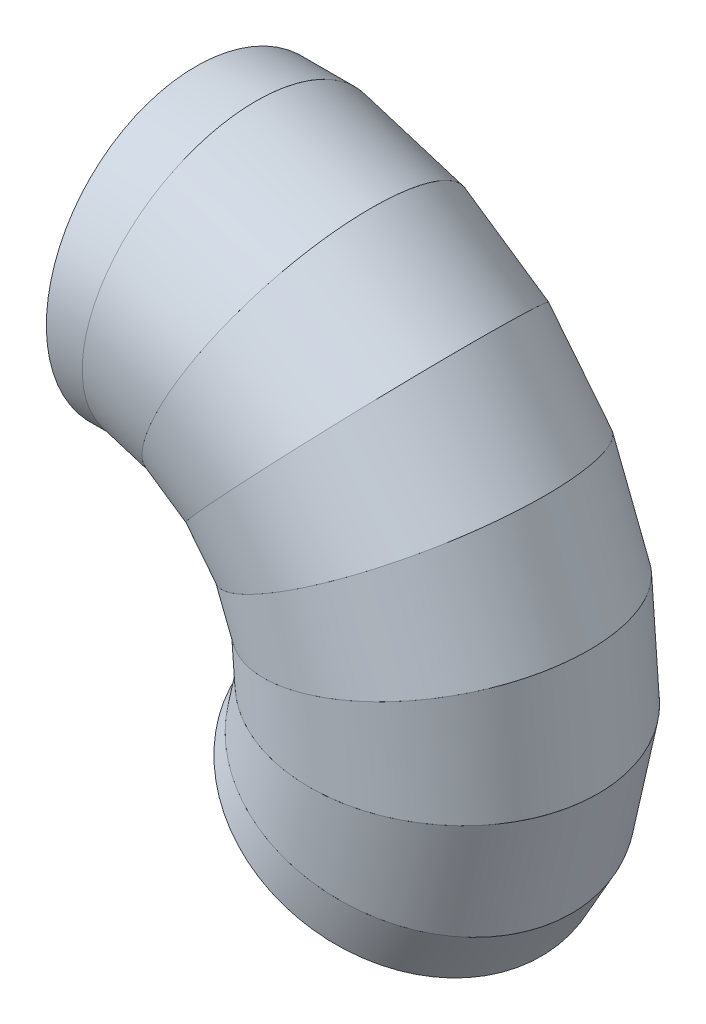
ISO-10303-21;
HEADER;
FILE_DESCRIPTION(('STEP AP214'),'2;1');
FILE_NAME('part.step','',(''),(''),'','','');
FILE_SCHEMA(('AUTOMOTIVE_DESIGN { 1 0 10303 214 1 1 1 1 }'));
ENDSEC;
DATA;
#1=APPLICATION_CONTEXT('core data for automotive mechanical design processes');
#2=APPLICATION_PROTOCOL_DEFINITION('international standard','automotive_design',2000,#1);
#3=PRODUCT_CONTEXT('',#1,'mechanical');
#4=PRODUCT('Part','Part','',(#3));
#5=PRODUCT_RELATED_PRODUCT_CATEGORY('part','',(#4));
#6=PRODUCT_DEFINITION_FORMATION('','',#4);
#7=PRODUCT_DEFINITION_CONTEXT('part definition',#1,'design');
#8=PRODUCT_DEFINITION('design','',#6,#7);
#9=PRODUCT_DEFINITION_SHAPE('','',#8);
#10=(LENGTH_UNIT() NAMED_UNIT(*) SI_UNIT(.MILLI.,.METRE.));
#11=(NAMED_UNIT(*) PLANE_ANGLE_UNIT() SI_UNIT($,.RADIAN.));
#12=(NAMED_UNIT(*) SI_UNIT($,.STERADIAN.) SOLID_ANGLE_UNIT());
#13=UNCERTAINTY_MEASURE_WITH_UNIT(LENGTH_MEASURE(1.E-05),#10,'distance_accuracy_value','');
#14=(GEOMETRIC_REPRESENTATION_CONTEXT(3) GLOBAL_UNCERTAINTY_ASSIGNED_CONTEXT((#13)) GLOBAL_UNIT_ASSIGNED_CONTEXT((#10,
#11,#12)) REPRESENTATION_CONTEXT('',''));
#15=CARTESIAN_POINT('',(0.,0.,0.));
#16=DIRECTION('',(0.,0.,1.));
#17=DIRECTION('',(1.,0.,0.));
#18=AXIS2_PLACEMENT_3D('',#15,#16,#17);
#19=CARTESIAN_POINT('',(259.807621135331,-150.000000000001,0.));
#20=DIRECTION('',(0.500000000000004,0.866025403784436,0.));
#21=DIRECTION('',(0.,0.,-1.));
#22=AXIS2_PLACEMENT_3D('',#19,#20,#21);
#23=PLANE('',#22);
#24=CARTESIAN_POINT('',(259.807621135331,-150.000000000001,0.));
#25=DIRECTION('',(-0.500000000000004,-0.866025403784436,0.));
#26=DIRECTION('',(0.,0.,-1.));
#27=AXIS2_PLACEMENT_3D('',#24,#25,#26);
#28=CIRCLE('',#27,180.);
#29=CARTESIAN_POINT('',(259.807621135331,-150.000000000001,-180.));
#30=VERTEX_POINT('',#29);
#31=EDGE_CURVE('E12',#30,#30,#28,.T.);
#32=ORIENTED_EDGE('',*,*,#31,.T.);
#33=EDGE_LOOP('',(#32));
#34=FACE_BOUND('',#33,.T.);
#35=CARTESIAN_POINT('',(259.807621135331,-150.000000000001,0.));
#36=DIRECTION('',(-0.500000000000004,-0.866025403784436,0.));
#37=DIRECTION('',(0.,0.,-1.));
#38=AXIS2_PLACEMENT_3D('',#35,#36,#37);
#39=CIRCLE('',#38,177.);
#40=CARTESIAN_POINT('',(259.807621135331,-150.000000000001,-177.));
#41=VERTEX_POINT('',#40);
#42=EDGE_CURVE('E68',#41,#41,#39,.T.);
#43=ORIENTED_EDGE('',*,*,#42,.F.);
#44=EDGE_LOOP('',(#43));
#45=FACE_BOUND('',#44,.T.);
#46=ADVANCED_FACE('F60',(#34,#45),#23,.F.);
#47=CARTESIAN_POINT('',(295.981800715506,-87.3444830450185,0.));
#48=DIRECTION('',(-0.500000000000004,-0.866025403784436,0.));
#49=DIRECTION('',(0.,0.,1.));
#50=AXIS2_PLACEMENT_3D('',#47,#48,#49);
#51=CYLINDRICAL_SURFACE('',#50,180.);
#52=CARTESIAN_POINT('',(282.41648337294,-110.840301903137,0.));
#53=DIRECTION('',(0.365341024366406,0.9308737486442,0.));
#54=DIRECTION('',(-0.9308737486442,0.365341024366406,0.));
#55=AXIS2_PLACEMENT_3D('',#52,#53,#54);
#56=ELLIPSE('',#55,182.033159996793,180.);
#57=CARTESIAN_POINT('',(112.966593349176,-44.3361207612548,0.));
#58=VERTEX_POINT('',#57);
#59=EDGE_CURVE('E72',#58,#58,#56,.T.);
#60=ORIENTED_EDGE('',*,*,#59,.F.);
#61=EDGE_LOOP('',(#60));
#62=FACE_BOUND('',#61,.T.);
#63=ORIENTED_EDGE('',*,*,#31,.F.);
#64=EDGE_LOOP('',(#63));
#65=FACE_BOUND('',#64,.T.);
#66=ADVANCED_FACE('F62',(#62,#65),#51,.T.);
#67=CARTESIAN_POINT('',(295.981800715506,-87.3444830450185,0.));
#68=DIRECTION('',(-0.500000000000004,-0.866025403784436,0.));
#69=DIRECTION('',(0.,0.,1.));
#70=AXIS2_PLACEMENT_3D('',#67,#68,#69);
#71=CYLINDRICAL_SURFACE('',#70,177.);
#72=CARTESIAN_POINT('',(282.41648337294,-110.840301903137,0.));
#73=DIRECTION('',(0.365341024366406,0.9308737486442,0.));
#74=DIRECTION('',(-0.9308737486442,0.365341024366406,0.));
#75=AXIS2_PLACEMENT_3D('',#72,#73,#74);
#76=ELLIPSE('',#75,178.999273996846,177.);
#77=CARTESIAN_POINT('',(115.790758182905,-45.4445237802862,0.));
#78=VERTEX_POINT('',#77);
#79=EDGE_CURVE('E64',#78,#78,#76,.T.);
#80=ORIENTED_EDGE('',*,*,#79,.T.);
#81=EDGE_LOOP('',(#80));
#82=FACE_BOUND('',#81,.T.);
#83=ORIENTED_EDGE('',*,*,#42,.T.);
#84=EDGE_LOOP('',(#83));
#85=FACE_BOUND('',#84,.T.);
#86=ADVANCED_FACE('F81',(#82,#85),#71,.F.);
#87=CARTESIAN_POINT('',(282.41648337294,-110.840301903137,0.));
#88=DIRECTION('',(-0.365341024366406,-0.9308737486442,0.));
#89=DIRECTION('',(-0.9308737486442,0.365341024366406,0.));
#90=AXIS2_PLACEMENT_3D('',#87,#88,#89);
#91=PLANE('',#90);
#92=ORIENTED_EDGE('',*,*,#79,.F.);
#93=EDGE_LOOP('',(#92));
#94=FACE_BOUND('',#93,.T.);
#95=ORIENTED_EDGE('',*,*,#59,.T.);
#96=EDGE_LOOP('',(#95));
#97=FACE_BOUND('',#96,.T.);
#98=ADVANCED_FACE('F84',(#94,#97),#91,.F.);
#99=CLOSED_SHELL('',(#46,#66,#86,#98));
#100=MANIFOLD_SOLID_BREP('B2',#99);
#101=CARTESIAN_POINT('',(308.577398105116,3.77815455909008,0.));
#102=DIRECTION('',(-0.222520933956311,-0.974927912181825,0.));
#103=DIRECTION('',(0.974927912181825,-0.222520933956311,0.));
#104=AXIS2_PLACEMENT_3D('',#101,#102,#103);
#105=CYLINDRICAL_SURFACE('',#104,180.);
#106=CARTESIAN_POINT('',(302.540263936152,-22.6722584706537,0.));
#107=DIRECTION('',(0.0747300935864207,0.997203797181181,0.));
#108=DIRECTION('',(-0.997203797181181,0.0747300935864207,0.));
#109=AXIS2_PLACEMENT_3D('',#106,#107,#108);
#110=ELLIPSE('',#109,182.033159996793,180.);
#111=CARTESIAN_POINT('',(121.016105574461,-9.0689033882615,0.));
#112=VERTEX_POINT('',#111);
#113=EDGE_CURVE('E59',#112,#112,#110,.F.);
#114=ORIENTED_EDGE('',*,*,#113,.T.);
#115=EDGE_LOOP('',(#114));
#116=FACE_BOUND('',#115,.T.);
#117=CARTESIAN_POINT('',(282.416483372942,-110.840301903133,0.));
#118=DIRECTION('',(-0.365341024366392,-0.930873748644206,0.));
#119=DIRECTION('',(0.930873748644206,-0.365341024366392,0.));
#120=AXIS2_PLACEMENT_3D('',#117,#118,#119);
#121=ELLIPSE('',#120,182.033159996793,180.);
#122=CARTESIAN_POINT('',(451.866373396707,-177.344483045013,0.));
#123=VERTEX_POINT('',#122);
#124=EDGE_CURVE('E140',#123,#123,#121,.F.);
#125=ORIENTED_EDGE('',*,*,#124,.T.);
#126=EDGE_LOOP('',(#125));
#127=FACE_BOUND('',#126,.T.);
#128=ADVANCED_FACE('F130',(#116,#127),#105,.T.);
#129=CARTESIAN_POINT('',(308.577398105116,3.77815455909008,0.));
#130=DIRECTION('',(-0.222520933956311,-0.974927912181825,0.));
#131=DIRECTION('',(0.974927912181825,-0.222520933956311,0.));
#132=AXIS2_PLACEMENT_3D('',#129,#130,#131);
#133=CYLINDRICAL_SURFACE('',#132,177.);
#134=CARTESIAN_POINT('',(302.540263936152,-22.6722584706537,0.));
#135=DIRECTION('',(0.0747300935864207,0.997203797181181,0.));
#136=DIRECTION('',(-0.997203797181181,0.0747300935864207,0.));
#137=AXIS2_PLACEMENT_3D('',#134,#135,#136);
#138=ELLIPSE('',#137,178.999273996846,177.);
#139=CARTESIAN_POINT('',(124.041508213823,-9.29562597296803,0.));
#140=VERTEX_POINT('',#139);
#141=EDGE_CURVE('E133',#140,#140,#138,.F.);
#142=ORIENTED_EDGE('',*,*,#141,.F.);
#143=EDGE_LOOP('',(#142));
#144=FACE_BOUND('',#143,.T.);
#145=CARTESIAN_POINT('',(282.416483372942,-110.840301903133,0.));
#146=DIRECTION('',(-0.365341024366392,-0.930873748644206,0.));
#147=DIRECTION('',(0.930873748644206,-0.365341024366392,0.));
#148=AXIS2_PLACEMENT_3D('',#145,#146,#147);
#149=ELLIPSE('',#148,178.999273996846,177.);
#150=CARTESIAN_POINT('',(449.042208562978,-176.236080025981,0.));
#151=VERTEX_POINT('',#150);
#152=EDGE_CURVE('E144',#151,#151,#149,.F.);
#153=ORIENTED_EDGE('',*,*,#152,.F.);
#154=EDGE_LOOP('',(#153));
#155=FACE_BOUND('',#154,.T.);
#156=ADVANCED_FACE('F150',(#144,#155),#133,.F.);
#157=CARTESIAN_POINT('',(302.540263936152,-22.6722584706537,0.));
#158=DIRECTION('',(0.0747300935864207,0.997203797181181,0.));
#159=DIRECTION('',(-0.997203797181181,0.0747300935864207,0.));
#160=AXIS2_PLACEMENT_3D('',#157,#158,#159);
#161=PLANE('',#160);
#162=ORIENTED_EDGE('',*,*,#113,.F.);
#163=EDGE_LOOP('',(#162));
#164=FACE_BOUND('',#163,.T.);
#165=ORIENTED_EDGE('',*,*,#141,.T.);
#166=EDGE_LOOP('',(#165));
#167=FACE_BOUND('',#166,.T.);
#168=ADVANCED_FACE('F152',(#164,#167),#161,.T.);
#169=CARTESIAN_POINT('',(282.416483372942,-110.840301903133,0.));
#170=DIRECTION('',(-0.365341024366392,-0.930873748644206,0.));
#171=DIRECTION('',(0.930873748644206,-0.365341024366392,0.));
#172=AXIS2_PLACEMENT_3D('',#169,#170,#171);
#173=PLANE('',#172);
#174=ORIENTED_EDGE('',*,*,#124,.F.);
#175=EDGE_LOOP('',(#174));
#176=FACE_BOUND('',#175,.T.);
#177=ORIENTED_EDGE('',*,*,#152,.T.);
#178=EDGE_LOOP('',(#177));
#179=FACE_BOUND('',#178,.T.);
#180=ADVANCED_FACE('F148',(#176,#179),#173,.T.);
#181=CLOSED_SHELL('',(#128,#156,#168,#180));
#182=MANIFOLD_SOLID_BREP('B7',#181);
#183=CARTESIAN_POINT('',(293.754539503476,94.56508655046,0.));
#184=DIRECTION('',(0.0747300935864282,-0.99720379718118,0.));
#185=DIRECTION('',(0.99720379718118,0.0747300935864282,0.));
#186=AXIS2_PLACEMENT_3D('',#183,#184,#185);
#187=CYLINDRICAL_SURFACE('',#186,180.);
#188=CARTESIAN_POINT('',(295.782014372555,67.5103146225106,0.));
#189=DIRECTION('',(-0.222520933956319,0.974927912181823,0.));
#190=DIRECTION('',(-0.974927912181823,-0.222520933956319,0.));
#191=AXIS2_PLACEMENT_3D('',#188,#189,#190);
#192=ELLIPSE('',#191,182.033159996793,180.);
#193=CARTESIAN_POINT('',(118.312805749022,27.0041258490043,0.));
#194=VERTEX_POINT('',#193);
#195=EDGE_CURVE('E129',#194,#194,#192,.F.);
#196=ORIENTED_EDGE('',*,*,#195,.T.);
#197=EDGE_LOOP('',(#196));
#198=FACE_BOUND('',#197,.T.);
#199=CARTESIAN_POINT('',(302.540263936152,-22.6722584706537,0.));
#200=DIRECTION('',(-0.0747300935864206,-0.997203797181181,0.));
#201=DIRECTION('',(0.997203797181181,-0.0747300935864206,0.));
#202=AXIS2_PLACEMENT_3D('',#199,#200,#201);
#203=ELLIPSE('',#202,182.033159996793,180.);
#204=CARTESIAN_POINT('',(484.064422297844,-36.2756135530459,0.));
#205=VERTEX_POINT('',#204);
#206=EDGE_CURVE('E210',#205,#205,#203,.F.);
#207=ORIENTED_EDGE('',*,*,#206,.T.);
#208=EDGE_LOOP('',(#207));
#209=FACE_BOUND('',#208,.T.);
#210=ADVANCED_FACE('F200',(#198,#209),#187,.T.);
#211=CARTESIAN_POINT('',(293.754539503476,94.56508655046,0.));
#212=DIRECTION('',(0.0747300935864282,-0.99720379718118,0.));
#213=DIRECTION('',(0.99720379718118,0.0747300935864282,0.));
#214=AXIS2_PLACEMENT_3D('',#211,#212,#213);
#215=CYLINDRICAL_SURFACE('',#214,177.);
#216=CARTESIAN_POINT('',(295.782014372555,67.5103146225106,0.));
#217=DIRECTION('',(-0.222520933956319,0.974927912181823,0.));
#218=DIRECTION('',(-0.974927912181823,-0.222520933956319,0.));
#219=AXIS2_PLACEMENT_3D('',#216,#217,#218);
#220=ELLIPSE('',#219,178.999273996846,177.);
#221=CARTESIAN_POINT('',(121.270625892748,27.6792289952294,0.));
#222=VERTEX_POINT('',#221);
#223=EDGE_CURVE('E203',#222,#222,#220,.F.);
#224=ORIENTED_EDGE('',*,*,#223,.F.);
#225=EDGE_LOOP('',(#224));
#226=FACE_BOUND('',#225,.T.);
#227=CARTESIAN_POINT('',(302.540263936152,-22.6722584706537,0.));
#228=DIRECTION('',(-0.0747300935864206,-0.997203797181181,0.));
#229=DIRECTION('',(0.997203797181181,-0.0747300935864206,0.));
#230=AXIS2_PLACEMENT_3D('',#227,#228,#229);
#231=ELLIPSE('',#230,178.999273996846,177.);
#232=CARTESIAN_POINT('',(481.039019658482,-36.0488909683394,0.));
#233=VERTEX_POINT('',#232);
#234=EDGE_CURVE('E214',#233,#233,#231,.F.);
#235=ORIENTED_EDGE('',*,*,#234,.F.);
#236=EDGE_LOOP('',(#235));
#237=FACE_BOUND('',#236,.T.);
#238=ADVANCED_FACE('F220',(#226,#237),#215,.F.);
#239=CARTESIAN_POINT('',(295.782014372555,67.5103146225106,0.));
#240=DIRECTION('',(-0.222520933956319,0.974927912181823,0.));
#241=DIRECTION('',(-0.974927912181823,-0.222520933956319,0.));
#242=AXIS2_PLACEMENT_3D('',#239,#240,#241);
#243=PLANE('',#242);
#244=ORIENTED_EDGE('',*,*,#195,.F.);
#245=EDGE_LOOP('',(#244));
#246=FACE_BOUND('',#245,.T.);
#247=ORIENTED_EDGE('',*,*,#223,.T.);
#248=EDGE_LOOP('',(#247));
#249=FACE_BOUND('',#248,.T.);
#250=ADVANCED_FACE('F222',(#246,#249),#243,.T.);
#251=CARTESIAN_POINT('',(302.540263936152,-22.6722584706537,0.));
#252=DIRECTION('',(-0.0747300935864206,-0.997203797181181,0.));
#253=DIRECTION('',(0.997203797181181,-0.0747300935864206,0.));
#254=AXIS2_PLACEMENT_3D('',#251,#252,#253);
#255=PLANE('',#254);
#256=ORIENTED_EDGE('',*,*,#206,.F.);
#257=EDGE_LOOP('',(#256));
#258=FACE_BOUND('',#257,.T.);
#259=ORIENTED_EDGE('',*,*,#234,.T.);
#260=EDGE_LOOP('',(#259));
#261=FACE_BOUND('',#260,.T.);
#262=ADVANCED_FACE('F218',(#258,#261),#255,.T.);
#263=CLOSED_SHELL('',(#210,#238,#250,#262));
#264=MANIFOLD_SOLID_BREP('B54',#263);
#265=CARTESIAN_POINT('',(252.830300946389,176.949495609774,0.));
#266=DIRECTION('',(0.365341024366399,-0.930873748644203,0.));
#267=DIRECTION('',(0.930873748644203,0.365341024366399,0.));
#268=AXIS2_PLACEMENT_3D('',#265,#266,#267);
#269=CYLINDRICAL_SURFACE('',#268,180.);
#270=CARTESIAN_POINT('',(262.742234813966,151.694299997329,0.));
#271=DIRECTION('',(-0.500000000000005,0.866025403784436,0.));
#272=DIRECTION('',(-0.866025403784436,-0.500000000000005,0.));
#273=AXIS2_PLACEMENT_3D('',#270,#271,#272);
#274=ELLIPSE('',#273,182.033159996793,180.);
#275=CARTESIAN_POINT('',(105.096893925587,60.6777199989317,0.));
#276=VERTEX_POINT('',#275);
#277=EDGE_CURVE('E199',#276,#276,#274,.F.);
#278=ORIENTED_EDGE('',*,*,#277,.T.);
#279=EDGE_LOOP('',(#278));
#280=FACE_BOUND('',#279,.T.);
#281=CARTESIAN_POINT('',(295.782014372555,67.5103146225107,0.));
#282=DIRECTION('',(0.222520933956319,-0.974927912181823,0.));
#283=DIRECTION('',(0.974927912181823,0.222520933956319,0.));
#284=AXIS2_PLACEMENT_3D('',#281,#282,#283);
#285=ELLIPSE('',#284,182.033159996793,180.);
#286=CARTESIAN_POINT('',(473.251222996088,108.016503396017,0.));
#287=VERTEX_POINT('',#286);
#288=EDGE_CURVE('E280',#287,#287,#285,.F.);
#289=ORIENTED_EDGE('',*,*,#288,.T.);
#290=EDGE_LOOP('',(#289));
#291=FACE_BOUND('',#290,.T.);
#292=ADVANCED_FACE('F270',(#280,#291),#269,.T.);
#293=CARTESIAN_POINT('',(252.830300946389,176.949495609774,0.));
#294=DIRECTION('',(0.365341024366399,-0.930873748644203,0.));
#295=DIRECTION('',(0.930873748644203,0.365341024366399,0.));
#296=AXIS2_PLACEMENT_3D('',#293,#294,#295);
#297=CYLINDRICAL_SURFACE('',#296,177.);
#298=CARTESIAN_POINT('',(262.742234813966,151.694299997329,0.));
#299=DIRECTION('',(-0.500000000000005,0.866025403784436,0.));
#300=DIRECTION('',(-0.866025403784436,-0.500000000000005,0.));
#301=AXIS2_PLACEMENT_3D('',#298,#299,#300);
#302=ELLIPSE('',#301,178.999273996846,177.);
#303=CARTESIAN_POINT('',(107.724316273726,62.1946629989049,0.));
#304=VERTEX_POINT('',#303);
#305=EDGE_CURVE('E273',#304,#304,#302,.F.);
#306=ORIENTED_EDGE('',*,*,#305,.F.);
#307=EDGE_LOOP('',(#306));
#308=FACE_BOUND('',#307,.T.);
#309=CARTESIAN_POINT('',(295.782014372555,67.5103146225107,0.));
#310=DIRECTION('',(0.222520933956319,-0.974927912181823,0.));
#311=DIRECTION('',(0.974927912181823,0.222520933956319,0.));
#312=AXIS2_PLACEMENT_3D('',#309,#310,#311);
#313=ELLIPSE('',#312,178.999273996846,177.);
#314=CARTESIAN_POINT('',(470.293402852363,107.341400249792,0.));
#315=VERTEX_POINT('',#314);
#316=EDGE_CURVE('E284',#315,#315,#313,.F.);
#317=ORIENTED_EDGE('',*,*,#316,.F.);
#318=EDGE_LOOP('',(#317));
#319=FACE_BOUND('',#318,.T.);
#320=ADVANCED_FACE('F290',(#308,#319),#297,.F.);
#321=CARTESIAN_POINT('',(262.742234813966,151.694299997329,0.));
#322=DIRECTION('',(-0.500000000000005,0.866025403784436,0.));
#323=DIRECTION('',(-0.866025403784436,-0.500000000000005,0.));
#324=AXIS2_PLACEMENT_3D('',#321,#322,#323);
#325=PLANE('',#324);
#326=ORIENTED_EDGE('',*,*,#277,.F.);
#327=EDGE_LOOP('',(#326));
#328=FACE_BOUND('',#327,.T.);
#329=ORIENTED_EDGE('',*,*,#305,.T.);
#330=EDGE_LOOP('',(#329));
#331=FACE_BOUND('',#330,.T.);
#332=ADVANCED_FACE('F292',(#328,#331),#325,.T.);
#333=CARTESIAN_POINT('',(295.782014372555,67.5103146225106,0.));
#334=DIRECTION('',(0.222520933956319,-0.974927912181823,0.));
#335=DIRECTION('',(0.974927912181823,0.222520933956319,0.));
#336=AXIS2_PLACEMENT_3D('',#333,#334,#335);
#337=PLANE('',#336);
#338=ORIENTED_EDGE('',*,*,#288,.F.);
#339=EDGE_LOOP('',(#338));
#340=FACE_BOUND('',#339,.T.);
#341=ORIENTED_EDGE('',*,*,#316,.T.);
#342=EDGE_LOOP('',(#341));
#343=FACE_BOUND('',#342,.T.);
#344=ADVANCED_FACE('F288',(#340,#343),#337,.T.);
#345=CLOSED_SHELL('',(#292,#320,#332,#344));
#346=MANIFOLD_SOLID_BREP('B124',#345);
#347=CARTESIAN_POINT('',(189.440980622715,243.611165454089,0.));
#348=DIRECTION('',(0.623489801858738,-0.781831482468027,0.));
#349=DIRECTION('',(0.781831482468027,0.623489801858738,0.));
#350=AXIS2_PLACEMENT_3D('',#347,#348,#349);
#351=CYLINDRICAL_SURFACE('',#350,180.);
#352=CARTESIAN_POINT('',(206.35665466685,222.399581117914,0.));
#353=DIRECTION('',(-0.73305187182983,0.680172737770915,0.));
#354=DIRECTION('',(-0.680172737770915,-0.73305187182983,0.));
#355=AXIS2_PLACEMENT_3D('',#352,#353,#354);
#356=ELLIPSE('',#355,182.033159996793,180.);
#357=CARTESIAN_POINT('',(82.54266186674,88.9598324471655,0.));
#358=VERTEX_POINT('',#357);
#359=EDGE_CURVE('E269',#358,#358,#356,.F.);
#360=ORIENTED_EDGE('',*,*,#359,.T.);
#361=EDGE_LOOP('',(#360));
#362=FACE_BOUND('',#361,.T.);
#363=CARTESIAN_POINT('',(262.742234813966,151.694299997329,0.));
#364=DIRECTION('',(0.500000000000004,-0.866025403784436,0.));
#365=DIRECTION('',(0.866025403784436,0.500000000000004,0.));
#366=AXIS2_PLACEMENT_3D('',#363,#364,#365);
#367=ELLIPSE('',#366,182.033159996793,180.);
#368=CARTESIAN_POINT('',(420.387575702346,242.710879995726,0.));
#369=VERTEX_POINT('',#368);
#370=EDGE_CURVE('E350',#369,#369,#367,.F.);
#371=ORIENTED_EDGE('',*,*,#370,.T.);
#372=EDGE_LOOP('',(#371));
#373=FACE_BOUND('',#372,.T.);
#374=ADVANCED_FACE('F340',(#362,#373),#351,.T.);
#375=CARTESIAN_POINT('',(189.440980622715,243.611165454089,0.));
#376=DIRECTION('',(0.623489801858738,-0.781831482468027,0.));
#377=DIRECTION('',(0.781831482468027,0.623489801858738,0.));
#378=AXIS2_PLACEMENT_3D('',#375,#376,#377);
#379=CYLINDRICAL_SURFACE('',#378,177.);
#380=CARTESIAN_POINT('',(206.35665466685,222.399581117914,0.));
#381=DIRECTION('',(-0.73305187182983,0.680172737770915,0.));
#382=DIRECTION('',(-0.680172737770915,-0.73305187182983,0.));
#383=AXIS2_PLACEMENT_3D('',#380,#381,#382);
#384=ELLIPSE('',#383,178.999273996846,177.);
#385=CARTESIAN_POINT('',(84.6062284134085,91.1838282583447,0.));
#386=VERTEX_POINT('',#385);
#387=EDGE_CURVE('E343',#386,#386,#384,.F.);
#388=ORIENTED_EDGE('',*,*,#387,.F.);
#389=EDGE_LOOP('',(#388));
#390=FACE_BOUND('',#389,.T.);
#391=CARTESIAN_POINT('',(262.742234813966,151.694299997329,0.));
#392=DIRECTION('',(0.500000000000004,-0.866025403784436,0.));
#393=DIRECTION('',(0.866025403784436,0.500000000000004,0.));
#394=AXIS2_PLACEMENT_3D('',#391,#392,#393);
#395=ELLIPSE('',#394,178.999273996846,177.);
#396=CARTESIAN_POINT('',(417.760153354206,241.193936995753,0.));
#397=VERTEX_POINT('',#396);
#398=EDGE_CURVE('E354',#397,#397,#395,.F.);
#399=ORIENTED_EDGE('',*,*,#398,.F.);
#400=EDGE_LOOP('',(#399));
#401=FACE_BOUND('',#400,.T.);
#402=ADVANCED_FACE('F360',(#390,#401),#379,.F.);
#403=CARTESIAN_POINT('',(206.356654666849,222.399581117913,0.));
#404=DIRECTION('',(-0.73305187182983,0.680172737770915,0.));
#405=DIRECTION('',(-0.680172737770915,-0.73305187182983,0.));
#406=AXIS2_PLACEMENT_3D('',#403,#404,#405);
#407=PLANE('',#406);
#408=ORIENTED_EDGE('',*,*,#359,.F.);
#409=EDGE_LOOP('',(#408));
#410=FACE_BOUND('',#409,.T.);
#411=ORIENTED_EDGE('',*,*,#387,.T.);
#412=EDGE_LOOP('',(#411));
#413=FACE_BOUND('',#412,.T.);
#414=ADVANCED_FACE('F362',(#410,#413),#407,.T.);
#415=CARTESIAN_POINT('',(262.742234813966,151.694299997329,0.));
#416=DIRECTION('',(0.500000000000004,-0.866025403784436,0.));
#417=DIRECTION('',(0.866025403784436,0.500000000000004,0.));
#418=AXIS2_PLACEMENT_3D('',#415,#416,#417);
#419=PLANE('',#418);
#420=ORIENTED_EDGE('',*,*,#370,.F.);
#421=EDGE_LOOP('',(#420));
#422=FACE_BOUND('',#421,.T.);
#423=ORIENTED_EDGE('',*,*,#398,.T.);
#424=EDGE_LOOP('',(#423));
#425=FACE_BOUND('',#424,.T.);
#426=ADVANCED_FACE('F358',(#422,#425),#419,.T.);
#427=CLOSED_SHELL('',(#374,#402,#414,#426));
#428=MANIFOLD_SOLID_BREP('B194',#427);
#429=CARTESIAN_POINT('',(109.218997822662,288.626914177817,0.));
#430=DIRECTION('',(0.826238774315998,-0.563320058063617,0.));
#431=DIRECTION('',(0.563320058063617,0.826238774315998,0.));
#432=AXIS2_PLACEMENT_3D('',#429,#430,#431);
#433=CYLINDRICAL_SURFACE('',#432,180.);
#434=CARTESIAN_POINT('',(131.63538017132,273.343683471685,0.));
#435=DIRECTION('',(-0.900968867902422,0.433883739117553,0.));
#436=DIRECTION('',(-0.433883739117553,-0.900968867902422,0.));
#437=AXIS2_PLACEMENT_3D('',#434,#435,#436);
#438=ELLIPSE('',#437,182.033159996793,180.);
#439=CARTESIAN_POINT('',(52.6541520685282,109.337473388674,0.));
#440=VERTEX_POINT('',#439);
#441=EDGE_CURVE('E339',#440,#440,#438,.F.);
#442=ORIENTED_EDGE('',*,*,#441,.T.);
#443=EDGE_LOOP('',(#442));
#444=FACE_BOUND('',#443,.T.);
#445=CARTESIAN_POINT('',(206.35665466685,222.399581117914,0.));
#446=DIRECTION('',(0.73305187182983,-0.680172737770915,0.));
#447=DIRECTION('',(0.680172737770915,0.73305187182983,0.));
#448=AXIS2_PLACEMENT_3D('',#445,#446,#447);
#449=ELLIPSE('',#448,182.033159996793,180.);
#450=CARTESIAN_POINT('',(330.170647466959,355.839329788662,0.));
#451=VERTEX_POINT('',#450);
#452=EDGE_CURVE('E420',#451,#451,#449,.F.);
#453=ORIENTED_EDGE('',*,*,#452,.T.);
#454=EDGE_LOOP('',(#453));
#455=FACE_BOUND('',#454,.T.);
#456=ADVANCED_FACE('F410',(#444,#455),#433,.T.);
#457=CARTESIAN_POINT('',(109.218997822662,288.626914177817,0.));
#458=DIRECTION('',(0.826238774315998,-0.563320058063617,0.));
#459=DIRECTION('',(0.563320058063617,0.826238774315998,0.));
#460=AXIS2_PLACEMENT_3D('',#457,#458,#459);
#461=CYLINDRICAL_SURFACE('',#460,177.);
#462=CARTESIAN_POINT('',(131.63538017132,273.343683471685,0.));
#463=DIRECTION('',(-0.900968867902422,0.433883739117553,0.));
#464=DIRECTION('',(-0.433883739117553,-0.900968867902422,0.));
#465=AXIS2_PLACEMENT_3D('',#462,#463,#464);
#466=ELLIPSE('',#465,178.999273996846,177.);
#467=CARTESIAN_POINT('',(53.9705058702414,112.070910223391,0.));
#468=VERTEX_POINT('',#467);
#469=EDGE_CURVE('E413',#468,#468,#466,.F.);
#470=ORIENTED_EDGE('',*,*,#469,.F.);
#471=EDGE_LOOP('',(#470));
#472=FACE_BOUND('',#471,.T.);
#473=CARTESIAN_POINT('',(206.35665466685,222.399581117914,0.));
#474=DIRECTION('',(0.73305187182983,-0.680172737770915,0.));
#475=DIRECTION('',(0.680172737770915,0.73305187182983,0.));
#476=AXIS2_PLACEMENT_3D('',#473,#474,#475);
#477=ELLIPSE('',#476,178.999273996846,177.);
#478=CARTESIAN_POINT('',(328.107080920291,353.615333977483,0.));
#479=VERTEX_POINT('',#478);
#480=EDGE_CURVE('E424',#479,#479,#477,.F.);
#481=ORIENTED_EDGE('',*,*,#480,.F.);
#482=EDGE_LOOP('',(#481));
#483=FACE_BOUND('',#482,.T.);
#484=ADVANCED_FACE('F430',(#472,#483),#461,.F.);
#485=CARTESIAN_POINT('',(131.63538017132,273.343683471685,0.));
#486=DIRECTION('',(-0.900968867902422,0.433883739117553,0.));
#487=DIRECTION('',(-0.433883739117553,-0.900968867902422,0.));
#488=AXIS2_PLACEMENT_3D('',#485,#486,#487);
#489=PLANE('',#488);
#490=ORIENTED_EDGE('',*,*,#441,.F.);
#491=EDGE_LOOP('',(#490));
#492=FACE_BOUND('',#491,.T.);
#493=ORIENTED_EDGE('',*,*,#469,.T.);
#494=EDGE_LOOP('',(#493));
#495=FACE_BOUND('',#494,.T.);
#496=ADVANCED_FACE('F432',(#492,#495),#489,.T.);
#497=CARTESIAN_POINT('',(206.356654666849,222.399581117913,0.));
#498=DIRECTION('',(0.73305187182983,-0.680172737770915,0.));
#499=DIRECTION('',(0.680172737770915,0.73305187182983,0.));
#500=AXIS2_PLACEMENT_3D('',#497,#498,#499);
#501=PLANE('',#500);
#502=ORIENTED_EDGE('',*,*,#452,.F.);
#503=EDGE_LOOP('',(#502));
#504=FACE_BOUND('',#503,.T.);
#505=ORIENTED_EDGE('',*,*,#480,.T.);
#506=EDGE_LOOP('',(#505));
#507=FACE_BOUND('',#506,.T.);
#508=ADVANCED_FACE('F428',(#504,#507),#501,.T.);
#509=CLOSED_SHELL('',(#456,#484,#496,#508));
#510=MANIFOLD_SOLID_BREP('B264',#509);
#511=CARTESIAN_POINT('',(19.2924277663875,307.996894958495,0.));
#512=DIRECTION('',(0.955572805786143,-0.294755174410898,0.));
#513=DIRECTION('',(0.294755174410898,0.955572805786143,0.));
#514=AXIS2_PLACEMENT_3D('',#511,#512,#513);
#515=CYLINDRICAL_SURFACE('',#514,180.);
#516=CARTESIAN_POINT('',(45.2177244752182,300.,0.));
#517=DIRECTION('',(-0.98883082622513,0.149042266176168,0.));
#518=DIRECTION('',(-0.149042266176168,-0.98883082622513,0.));
#519=AXIS2_PLACEMENT_3D('',#516,#517,#518);
#520=ELLIPSE('',#519,182.033159996793,180.);
#521=CARTESIAN_POINT('',(18.0870897900873,120.,0.));
#522=VERTEX_POINT('',#521);
#523=EDGE_CURVE('E409',#522,#522,#520,.F.);
#524=ORIENTED_EDGE('',*,*,#523,.T.);
#525=EDGE_LOOP('',(#524));
#526=FACE_BOUND('',#525,.T.);
#527=CARTESIAN_POINT('',(131.63538017132,273.343683471685,0.));
#528=DIRECTION('',(0.900968867902422,-0.433883739117552,0.));
#529=DIRECTION('',(0.433883739117552,0.900968867902422,0.));
#530=AXIS2_PLACEMENT_3D('',#527,#528,#529);
#531=ELLIPSE('',#530,182.033159996793,180.);
#532=CARTESIAN_POINT('',(210.616608274113,437.349893554696,0.));
#533=VERTEX_POINT('',#532);
#534=EDGE_CURVE('E489',#533,#533,#531,.F.);
#535=ORIENTED_EDGE('',*,*,#534,.T.);
#536=EDGE_LOOP('',(#535));
#537=FACE_BOUND('',#536,.T.);
#538=ADVANCED_FACE('F479',(#526,#537),#515,.T.);
#539=CARTESIAN_POINT('',(19.2924277663875,307.996894958495,0.));
#540=DIRECTION('',(0.955572805786143,-0.294755174410898,0.));
#541=DIRECTION('',(0.294755174410898,0.955572805786143,0.));
#542=AXIS2_PLACEMENT_3D('',#539,#540,#541);
#543=CYLINDRICAL_SURFACE('',#542,177.);
#544=CARTESIAN_POINT('',(45.2177244752182,300.,0.));
#545=DIRECTION('',(-0.98883082622513,0.149042266176168,0.));
#546=DIRECTION('',(-0.149042266176168,-0.98883082622513,0.));
#547=AXIS2_PLACEMENT_3D('',#544,#545,#546);
#548=ELLIPSE('',#547,178.999273996846,177.);
#549=CARTESIAN_POINT('',(18.5392670348395,123.,0.));
#550=VERTEX_POINT('',#549);
#551=EDGE_CURVE('E482',#550,#550,#548,.F.);
#552=ORIENTED_EDGE('',*,*,#551,.F.);
#553=EDGE_LOOP('',(#552));
#554=FACE_BOUND('',#553,.T.);
#555=CARTESIAN_POINT('',(131.63538017132,273.343683471685,0.));
#556=DIRECTION('',(0.900968867902422,-0.433883739117552,0.));
#557=DIRECTION('',(0.433883739117552,0.900968867902422,0.));
#558=AXIS2_PLACEMENT_3D('',#555,#556,#557);
#559=ELLIPSE('',#558,178.999273996846,177.);
#560=CARTESIAN_POINT('',(209.300254472399,434.616456719979,0.));
#561=VERTEX_POINT('',#560);
#562=EDGE_CURVE('E493',#561,#561,#559,.F.);
#563=ORIENTED_EDGE('',*,*,#562,.F.);
#564=EDGE_LOOP('',(#563));
#565=FACE_BOUND('',#564,.T.);
#566=ADVANCED_FACE('F499',(#554,#565),#543,.F.);
#567=CARTESIAN_POINT('',(45.2177244752182,300.,0.));
#568=DIRECTION('',(-0.98883082622513,0.149042266176168,0.));
#569=DIRECTION('',(-0.149042266176168,-0.98883082622513,0.));
#570=AXIS2_PLACEMENT_3D('',#567,#568,#569);
#571=PLANE('',#570);
#572=ORIENTED_EDGE('',*,*,#523,.F.);
#573=EDGE_LOOP('',(#572));
#574=FACE_BOUND('',#573,.T.);
#575=ORIENTED_EDGE('',*,*,#551,.T.);
#576=EDGE_LOOP('',(#575));
#577=FACE_BOUND('',#576,.T.);
#578=ADVANCED_FACE('F501',(#574,#577),#571,.T.);
#579=CARTESIAN_POINT('',(131.63538017132,273.343683471685,0.));
#580=DIRECTION('',(0.900968867902422,-0.433883739117552,0.));
#581=DIRECTION('',(0.433883739117552,0.900968867902422,0.));
#582=AXIS2_PLACEMENT_3D('',#579,#580,#581);
#583=PLANE('',#582);
#584=ORIENTED_EDGE('',*,*,#534,.F.);
#585=EDGE_LOOP('',(#584));
#586=FACE_BOUND('',#585,.T.);
#587=ORIENTED_EDGE('',*,*,#562,.T.);
#588=EDGE_LOOP('',(#587));
#589=FACE_BOUND('',#588,.T.);
#590=ADVANCED_FACE('F497',(#586,#589),#583,.T.);
#591=CLOSED_SHELL('',(#538,#566,#578,#590));
#592=MANIFOLD_SOLID_BREP('B334',#591);
#593=CARTESIAN_POINT('',(0.,300.,0.));
#594=DIRECTION('',(1.,0.,0.));
#595=DIRECTION('',(0.,0.,-1.));
#596=AXIS2_PLACEMENT_3D('',#593,#594,#595);
#597=PLANE('',#596);
#598=CARTESIAN_POINT('',(0.,300.,0.));
#599=DIRECTION('',(1.,0.,0.));
#600=DIRECTION('',(0.,0.,-1.));
#601=AXIS2_PLACEMENT_3D('',#598,#599,#600);
#602=CIRCLE('',#601,180.);
#603=CARTESIAN_POINT('',(0.,300.,-180.));
#604=VERTEX_POINT('',#603);
#605=EDGE_CURVE('E478',#604,#604,#602,.T.);
#606=ORIENTED_EDGE('',*,*,#605,.F.);
#607=EDGE_LOOP('',(#606));
#608=FACE_BOUND('',#607,.T.);
#609=CARTESIAN_POINT('',(0.,300.,0.));
#610=DIRECTION('',(1.,0.,0.));
#611=DIRECTION('',(0.,0.,-1.));
#612=AXIS2_PLACEMENT_3D('',#609,#610,#611);
#613=CIRCLE('',#612,177.);
#614=CARTESIAN_POINT('',(0.,300.,-177.));
#615=VERTEX_POINT('',#614);
#616=EDGE_CURVE('E549',#615,#615,#613,.T.);
#617=ORIENTED_EDGE('',*,*,#616,.T.);
#618=EDGE_LOOP('',(#617));
#619=FACE_BOUND('',#618,.T.);
#620=ADVANCED_FACE('F541',(#608,#619),#597,.F.);
#621=CARTESIAN_POINT('',(72.348359160349,300.,0.));
#622=DIRECTION('',(-1.,0.,0.));
#623=DIRECTION('',(0.,0.,1.));
#624=AXIS2_PLACEMENT_3D('',#621,#622,#623);
#625=CYLINDRICAL_SURFACE('',#624,180.);
#626=CARTESIAN_POINT('',(45.2177244752182,300.,0.));
#627=DIRECTION('',(-0.98883082622513,0.149042266176168,0.));
#628=DIRECTION('',(-0.149042266176168,-0.98883082622513,0.));
#629=AXIS2_PLACEMENT_3D('',#626,#627,#628);
#630=ELLIPSE('',#629,182.033159996793,180.);
#631=CARTESIAN_POINT('',(18.0870897900873,120.,0.));
#632=VERTEX_POINT('',#631);
#633=EDGE_CURVE('E553',#632,#632,#630,.T.);
#634=ORIENTED_EDGE('',*,*,#633,.T.);
#635=EDGE_LOOP('',(#634));
#636=FACE_BOUND('',#635,.T.);
#637=ORIENTED_EDGE('',*,*,#605,.T.);
#638=EDGE_LOOP('',(#637));
#639=FACE_BOUND('',#638,.T.);
#640=ADVANCED_FACE('F543',(#636,#639),#625,.T.);
#641=CARTESIAN_POINT('',(72.348359160349,300.,0.));
#642=DIRECTION('',(-1.,0.,0.));
#643=DIRECTION('',(0.,0.,1.));
#644=AXIS2_PLACEMENT_3D('',#641,#642,#643);
#645=CYLINDRICAL_SURFACE('',#644,177.);
#646=CARTESIAN_POINT('',(45.2177244752182,300.,0.));
#647=DIRECTION('',(-0.98883082622513,0.149042266176168,0.));
#648=DIRECTION('',(-0.149042266176168,-0.98883082622513,0.));
#649=AXIS2_PLACEMENT_3D('',#646,#647,#648);
#650=ELLIPSE('',#649,178.999273996846,177.);
#651=CARTESIAN_POINT('',(18.5392670348395,123.,0.));
#652=VERTEX_POINT('',#651);
#653=EDGE_CURVE('E545',#652,#652,#650,.T.);
#654=ORIENTED_EDGE('',*,*,#653,.F.);
#655=EDGE_LOOP('',(#654));
#656=FACE_BOUND('',#655,.T.);
#657=ORIENTED_EDGE('',*,*,#616,.F.);
#658=EDGE_LOOP('',(#657));
#659=FACE_BOUND('',#658,.T.);
#660=ADVANCED_FACE('F565',(#656,#659),#645,.F.);
#661=CARTESIAN_POINT('',(45.2177244752182,300.,0.));
#662=DIRECTION('',(-0.98883082622513,0.149042266176168,0.));
#663=DIRECTION('',(-0.149042266176168,-0.98883082622513,0.));
#664=AXIS2_PLACEMENT_3D('',#661,#662,#663);
#665=PLANE('',#664);
#666=ORIENTED_EDGE('',*,*,#653,.T.);
#667=EDGE_LOOP('',(#666));
#668=FACE_BOUND('',#667,.T.);
#669=ORIENTED_EDGE('',*,*,#633,.F.);
#670=EDGE_LOOP('',(#669));
#671=FACE_BOUND('',#670,.T.);
#672=ADVANCED_FACE('F562',(#668,#671),#665,.F.);
#673=CLOSED_SHELL('',(#620,#640,#660,#672));
#674=MANIFOLD_SOLID_BREP('B404',#673);
#675=ADVANCED_BREP_SHAPE_REPRESENTATION('',(#18,#100,#182,#264,#346,#428,#510,#592,#674),#14);
#676=SHAPE_DEFINITION_REPRESENTATION(#9,#675);
ENDSEC;
END-ISO-10303-21;
